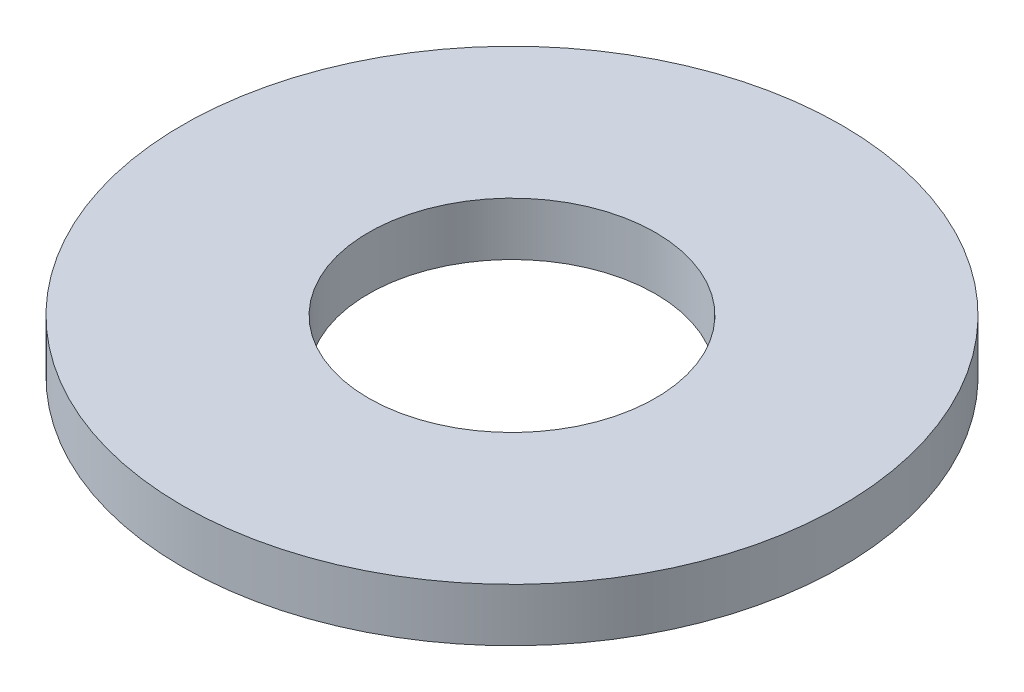
ISO-10303-21;
HEADER;
FILE_DESCRIPTION(('STEP AP214'),'2;1');
FILE_NAME('part.step','',(''),(''),'','','');
FILE_SCHEMA(('AUTOMOTIVE_DESIGN { 1 0 10303 214 1 1 1 1 }'));
ENDSEC;
DATA;
#1=APPLICATION_CONTEXT('core data for automotive mechanical design processes');
#2=APPLICATION_PROTOCOL_DEFINITION('international standard','automotive_design',2000,#1);
#3=PRODUCT_CONTEXT('',#1,'mechanical');
#4=PRODUCT('Part','Part','',(#3));
#5=PRODUCT_RELATED_PRODUCT_CATEGORY('part','',(#4));
#6=PRODUCT_DEFINITION_FORMATION('','',#4);
#7=PRODUCT_DEFINITION_CONTEXT('part definition',#1,'design');
#8=PRODUCT_DEFINITION('design','',#6,#7);
#9=PRODUCT_DEFINITION_SHAPE('','',#8);
#10=(LENGTH_UNIT() NAMED_UNIT(*) SI_UNIT(.MILLI.,.METRE.));
#11=(NAMED_UNIT(*) PLANE_ANGLE_UNIT() SI_UNIT($,.RADIAN.));
#12=(NAMED_UNIT(*) SI_UNIT($,.STERADIAN.) SOLID_ANGLE_UNIT());
#13=UNCERTAINTY_MEASURE_WITH_UNIT(LENGTH_MEASURE(1.E-05),#10,'distance_accuracy_value','');
#14=(GEOMETRIC_REPRESENTATION_CONTEXT(3) GLOBAL_UNCERTAINTY_ASSIGNED_CONTEXT((#13)) GLOBAL_UNIT_ASSIGNED_CONTEXT((#10,
#11,#12)) REPRESENTATION_CONTEXT('',''));
#15=CARTESIAN_POINT('',(0.,0.,0.));
#16=DIRECTION('',(0.,0.,1.));
#17=DIRECTION('',(1.,0.,0.));
#18=AXIS2_PLACEMENT_3D('',#15,#16,#17);
#19=CARTESIAN_POINT('',(0.,0.5,0.));
#20=DIRECTION('',(0.,1.,0.));
#21=DIRECTION('',(0.,0.,1.));
#22=AXIS2_PLACEMENT_3D('',#19,#20,#21);
#23=PLANE('',#22);
#24=CARTESIAN_POINT('',(0.,0.5,0.));
#25=DIRECTION('',(0.,1.,0.));
#26=DIRECTION('',(0.,0.,1.));
#27=AXIS2_PLACEMENT_3D('',#24,#25,#26);
#28=CIRCLE('',#27,3.1);
#29=CARTESIAN_POINT('',(0.,0.5,3.1));
#30=VERTEX_POINT('',#29);
#31=EDGE_CURVE('E10',#30,#30,#28,.T.);
#32=ORIENTED_EDGE('',*,*,#31,.T.);
#33=EDGE_LOOP('',(#32));
#34=FACE_BOUND('',#33,.T.);
#35=CARTESIAN_POINT('',(0.,0.5,0.));
#36=DIRECTION('',(0.,1.,0.));
#37=DIRECTION('',(0.,0.,1.));
#38=AXIS2_PLACEMENT_3D('',#35,#36,#37);
#39=CIRCLE('',#38,1.35);
#40=CARTESIAN_POINT('',(0.,0.5,1.35));
#41=VERTEX_POINT('',#40);
#42=EDGE_CURVE('E35',#41,#41,#39,.T.);
#43=ORIENTED_EDGE('',*,*,#42,.F.);
#44=EDGE_LOOP('',(#43));
#45=FACE_BOUND('',#44,.T.);
#46=ADVANCED_FACE('F24',(#34,#45),#23,.T.);
#47=CARTESIAN_POINT('',(0.,0.,0.));
#48=DIRECTION('',(0.,1.,0.));
#49=DIRECTION('',(0.,0.,1.));
#50=AXIS2_PLACEMENT_3D('',#47,#48,#49);
#51=PLANE('',#50);
#52=CARTESIAN_POINT('',(0.,0.,0.));
#53=DIRECTION('',(0.,1.,0.));
#54=DIRECTION('',(0.,0.,1.));
#55=AXIS2_PLACEMENT_3D('',#52,#53,#54);
#56=CIRCLE('',#55,3.1);
#57=CARTESIAN_POINT('',(0.,0.,3.1));
#58=VERTEX_POINT('',#57);
#59=EDGE_CURVE('E31',#58,#58,#56,.T.);
#60=ORIENTED_EDGE('',*,*,#59,.F.);
#61=EDGE_LOOP('',(#60));
#62=FACE_BOUND('',#61,.T.);
#63=CARTESIAN_POINT('',(0.,0.,0.));
#64=DIRECTION('',(0.,1.,0.));
#65=DIRECTION('',(0.,0.,1.));
#66=AXIS2_PLACEMENT_3D('',#63,#64,#65);
#67=CIRCLE('',#66,1.35);
#68=CARTESIAN_POINT('',(0.,0.,1.35));
#69=VERTEX_POINT('',#68);
#70=EDGE_CURVE('E39',#69,#69,#67,.T.);
#71=ORIENTED_EDGE('',*,*,#70,.T.);
#72=EDGE_LOOP('',(#71));
#73=FACE_BOUND('',#72,.T.);
#74=ADVANCED_FACE('F45',(#62,#73),#51,.F.);
#75=CARTESIAN_POINT('',(0.,0.5,0.));
#76=DIRECTION('',(0.,-1.,0.));
#77=DIRECTION('',(0.,0.,-1.));
#78=AXIS2_PLACEMENT_3D('',#75,#76,#77);
#79=CYLINDRICAL_SURFACE('',#78,3.1);
#80=ORIENTED_EDGE('',*,*,#31,.F.);
#81=EDGE_LOOP('',(#80));
#82=FACE_BOUND('',#81,.T.);
#83=ORIENTED_EDGE('',*,*,#59,.T.);
#84=EDGE_LOOP('',(#83));
#85=FACE_BOUND('',#84,.T.);
#86=ADVANCED_FACE('F26',(#82,#85),#79,.T.);
#87=CARTESIAN_POINT('',(0.,0.5,0.));
#88=DIRECTION('',(0.,-1.,0.));
#89=DIRECTION('',(0.,0.,-1.));
#90=AXIS2_PLACEMENT_3D('',#87,#88,#89);
#91=CYLINDRICAL_SURFACE('',#90,1.35);
#92=ORIENTED_EDGE('',*,*,#42,.T.);
#93=EDGE_LOOP('',(#92));
#94=FACE_BOUND('',#93,.T.);
#95=ORIENTED_EDGE('',*,*,#70,.F.);
#96=EDGE_LOOP('',(#95));
#97=FACE_BOUND('',#96,.T.);
#98=ADVANCED_FACE('F47',(#94,#97),#91,.F.);
#99=CLOSED_SHELL('',(#46,#74,#86,#98));
#100=MANIFOLD_SOLID_BREP('B2',#99);
#101=ADVANCED_BREP_SHAPE_REPRESENTATION('',(#18,#100),#14);
#102=SHAPE_DEFINITION_REPRESENTATION(#9,#101);
ENDSEC;
END-ISO-10303-21;
